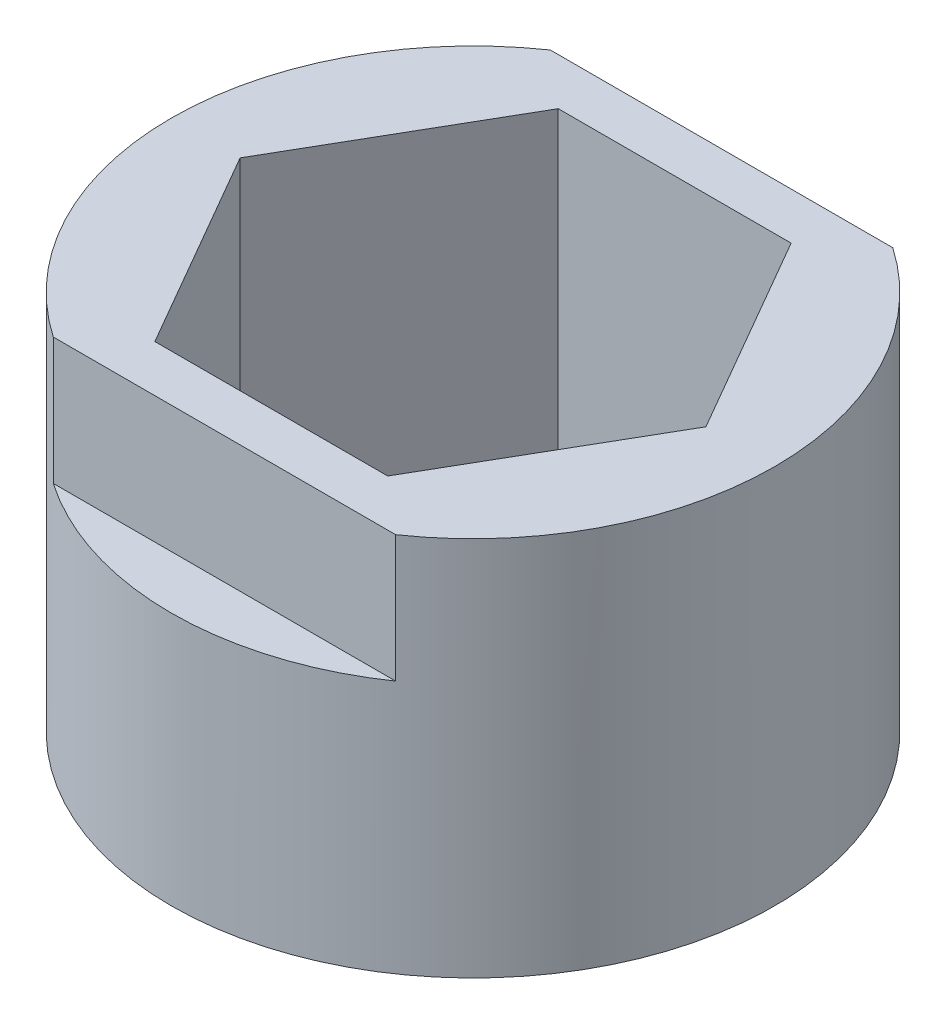
ISO-10303-21;
HEADER;
FILE_DESCRIPTION(('STEP AP214'),'2;1');
FILE_NAME('part.step','',(''),(''),'','','');
FILE_SCHEMA(('AUTOMOTIVE_DESIGN { 1 0 10303 214 1 1 1 1 }'));
ENDSEC;
DATA;
#1=APPLICATION_CONTEXT('core data for automotive mechanical design processes');
#2=APPLICATION_PROTOCOL_DEFINITION('international standard','automotive_design',2000,#1);
#3=PRODUCT_CONTEXT('',#1,'mechanical');
#4=PRODUCT('Part','Part','',(#3));
#5=PRODUCT_RELATED_PRODUCT_CATEGORY('part','',(#4));
#6=PRODUCT_DEFINITION_FORMATION('','',#4);
#7=PRODUCT_DEFINITION_CONTEXT('part definition',#1,'design');
#8=PRODUCT_DEFINITION('design','',#6,#7);
#9=PRODUCT_DEFINITION_SHAPE('','',#8);
#10=(LENGTH_UNIT() NAMED_UNIT(*) SI_UNIT(.MILLI.,.METRE.));
#11=(NAMED_UNIT(*) PLANE_ANGLE_UNIT() SI_UNIT($,.RADIAN.));
#12=(NAMED_UNIT(*) SI_UNIT($,.STERADIAN.) SOLID_ANGLE_UNIT());
#13=UNCERTAINTY_MEASURE_WITH_UNIT(LENGTH_MEASURE(1.E-05),#10,'distance_accuracy_value','');
#14=(GEOMETRIC_REPRESENTATION_CONTEXT(3) GLOBAL_UNCERTAINTY_ASSIGNED_CONTEXT((#13)) GLOBAL_UNIT_ASSIGNED_CONTEXT((#10,
#11,#12)) REPRESENTATION_CONTEXT('',''));
#15=CARTESIAN_POINT('',(0.,0.,0.));
#16=DIRECTION('',(0.,0.,1.));
#17=DIRECTION('',(1.,0.,0.));
#18=AXIS2_PLACEMENT_3D('',#15,#16,#17);
#19=CARTESIAN_POINT('',(0.,8.89,0.));
#20=DIRECTION('',(0.,1.,0.));
#21=DIRECTION('',(0.,0.,1.));
#22=AXIS2_PLACEMENT_3D('',#19,#20,#21);
#23=PLANE('',#22);
#24=DIRECTION('',(-1.,0.,0.));
#25=VECTOR('',#24,1.);
#26=CARTESIAN_POINT('',(0.,8.89,6.223));
#27=LINE('',#26,#25);
#28=CARTESIAN_POINT('',(4.28660276326137,8.89,6.223));
#29=VERTEX_POINT('',#28);
#30=CARTESIAN_POINT('',(-4.28660276326137,8.89,6.223));
#31=VERTEX_POINT('',#30);
#32=EDGE_CURVE('E151',#29,#31,#27,.T.);
#33=ORIENTED_EDGE('',*,*,#32,.F.);
#34=CARTESIAN_POINT('',(0.,8.89,0.));
#35=DIRECTION('',(0.,1.,0.));
#36=DIRECTION('',(0.,0.,1.));
#37=AXIS2_PLACEMENT_3D('',#34,#35,#36);
#38=CIRCLE('',#37,7.5565);
#39=CARTESIAN_POINT('',(4.28660276326137,8.89,-6.223));
#40=VERTEX_POINT('',#39);
#41=EDGE_CURVE('E153',#29,#40,#38,.T.);
#42=ORIENTED_EDGE('',*,*,#41,.T.);
#43=DIRECTION('',(1.,0.,0.));
#44=VECTOR('',#43,1.);
#45=CARTESIAN_POINT('',(0.,8.89,-6.223));
#46=LINE('',#45,#44);
#47=CARTESIAN_POINT('',(-4.28660276326137,8.89,-6.223));
#48=VERTEX_POINT('',#47);
#49=EDGE_CURVE('E62',#48,#40,#46,.T.);
#50=ORIENTED_EDGE('',*,*,#49,.F.);
#51=EDGE_CURVE('E135',#48,#31,#38,.T.);
#52=ORIENTED_EDGE('',*,*,#51,.T.);
#53=EDGE_LOOP('',(#33,#42,#50,#52));
#54=FACE_BOUND('',#53,.T.);
#55=DIRECTION('',(-0.5,0.,0.866025403784439));
#56=VECTOR('',#55,1.);
#57=CARTESIAN_POINT('',(-2.91561885940761,8.89,-5.05));
#58=LINE('',#57,#56);
#59=CARTESIAN_POINT('',(-2.91561885940761,8.89,-5.05));
#60=VERTEX_POINT('',#59);
#61=CARTESIAN_POINT('',(-5.83123771881522,8.89,0.));
#62=VERTEX_POINT('',#61);
#63=EDGE_CURVE('E190',#60,#62,#58,.T.);
#64=ORIENTED_EDGE('',*,*,#63,.F.);
#65=DIRECTION('',(-1.,0.,0.));
#66=VECTOR('',#65,1.);
#67=CARTESIAN_POINT('',(2.91561885940761,8.89,-5.05));
#68=LINE('',#67,#66);
#69=CARTESIAN_POINT('',(2.91561885940761,8.89,-5.05));
#70=VERTEX_POINT('',#69);
#71=EDGE_CURVE('E187',#70,#60,#68,.T.);
#72=ORIENTED_EDGE('',*,*,#71,.F.);
#73=DIRECTION('',(-0.5,0.,-0.866025403784439));
#74=VECTOR('',#73,1.);
#75=CARTESIAN_POINT('',(5.83123771881522,8.89,0.));
#76=LINE('',#75,#74);
#77=CARTESIAN_POINT('',(5.83123771881522,8.89,0.));
#78=VERTEX_POINT('',#77);
#79=EDGE_CURVE('E204',#78,#70,#76,.T.);
#80=ORIENTED_EDGE('',*,*,#79,.F.);
#81=DIRECTION('',(0.5,0.,-0.866025403784439));
#82=VECTOR('',#81,1.);
#83=CARTESIAN_POINT('',(2.91561885940761,8.89,5.05));
#84=LINE('',#83,#82);
#85=CARTESIAN_POINT('',(2.91561885940761,8.89,5.05));
#86=VERTEX_POINT('',#85);
#87=EDGE_CURVE('E200',#86,#78,#84,.T.);
#88=ORIENTED_EDGE('',*,*,#87,.F.);
#89=DIRECTION('',(1.,0.,0.));
#90=VECTOR('',#89,1.);
#91=CARTESIAN_POINT('',(-2.91561885940761,8.89,5.05));
#92=LINE('',#91,#90);
#93=CARTESIAN_POINT('',(-2.91561885940761,8.89,5.05));
#94=VERTEX_POINT('',#93);
#95=EDGE_CURVE('E197',#94,#86,#92,.T.);
#96=ORIENTED_EDGE('',*,*,#95,.F.);
#97=DIRECTION('',(0.5,0.,0.866025403784439));
#98=VECTOR('',#97,1.);
#99=CARTESIAN_POINT('',(-5.83123771881522,8.89,0.));
#100=LINE('',#99,#98);
#101=EDGE_CURVE('E194',#62,#94,#100,.T.);
#102=ORIENTED_EDGE('',*,*,#101,.F.);
#103=EDGE_LOOP('',(#64,#72,#80,#88,#96,#102));
#104=FACE_BOUND('',#103,.T.);
#105=ADVANCED_FACE('F39',(#54,#104),#23,.T.);
#106=CARTESIAN_POINT('',(0.,8.89,0.));
#107=DIRECTION('',(0.,-1.,0.));
#108=DIRECTION('',(0.,0.,-1.));
#109=AXIS2_PLACEMENT_3D('',#106,#107,#108);
#110=CYLINDRICAL_SURFACE('',#109,7.5565);
#111=ORIENTED_EDGE('',*,*,#41,.F.);
#112=DIRECTION('',(0.,-1.,0.));
#113=VECTOR('',#112,1.);
#114=CARTESIAN_POINT('',(4.28660276326137,8.89,6.223));
#115=LINE('',#114,#113);
#116=CARTESIAN_POINT('',(4.28660276326137,5.715,6.223));
#117=VERTEX_POINT('',#116);
#118=EDGE_CURVE('E11',#29,#117,#115,.T.);
#119=ORIENTED_EDGE('',*,*,#118,.T.);
#120=CARTESIAN_POINT('',(0.,5.715,0.));
#121=DIRECTION('',(0.,-1.,0.));
#122=DIRECTION('',(0.,0.,-1.));
#123=AXIS2_PLACEMENT_3D('',#120,#121,#122);
#124=CIRCLE('',#123,7.5565);
#125=CARTESIAN_POINT('',(-4.28660276326137,5.715,6.223));
#126=VERTEX_POINT('',#125);
#127=EDGE_CURVE('E137',#117,#126,#124,.T.);
#128=ORIENTED_EDGE('',*,*,#127,.T.);
#129=DIRECTION('',(0.,-1.,0.));
#130=VECTOR('',#129,1.);
#131=CARTESIAN_POINT('',(-4.28660276326137,8.89,6.223));
#132=LINE('',#131,#130);
#133=EDGE_CURVE('E48',#126,#31,#132,.F.);
#134=ORIENTED_EDGE('',*,*,#133,.T.);
#135=ORIENTED_EDGE('',*,*,#51,.F.);
#136=DIRECTION('',(0.,-1.,0.));
#137=VECTOR('',#136,1.);
#138=CARTESIAN_POINT('',(-4.28660276326137,8.89,-6.223));
#139=LINE('',#138,#137);
#140=CARTESIAN_POINT('',(-4.28660276326137,5.715,-6.223));
#141=VERTEX_POINT('',#140);
#142=EDGE_CURVE('E124',#48,#141,#139,.T.);
#143=ORIENTED_EDGE('',*,*,#142,.T.);
#144=CARTESIAN_POINT('',(0.,5.715,0.));
#145=DIRECTION('',(0.,-1.,0.));
#146=DIRECTION('',(0.,0.,-1.));
#147=AXIS2_PLACEMENT_3D('',#144,#145,#146);
#148=CIRCLE('',#147,7.5565);
#149=CARTESIAN_POINT('',(4.28660276326137,5.715,-6.223));
#150=VERTEX_POINT('',#149);
#151=EDGE_CURVE('E117',#141,#150,#148,.T.);
#152=ORIENTED_EDGE('',*,*,#151,.T.);
#153=DIRECTION('',(0.,-1.,0.));
#154=VECTOR('',#153,1.);
#155=CARTESIAN_POINT('',(4.28660276326137,8.89,-6.223));
#156=LINE('',#155,#154);
#157=EDGE_CURVE('E125',#150,#40,#156,.F.);
#158=ORIENTED_EDGE('',*,*,#157,.T.);
#159=EDGE_LOOP('',(#111,#119,#128,#134,#135,#143,#152,#158));
#160=FACE_BOUND('',#159,.T.);
#161=CARTESIAN_POINT('',(0.,-0.635,0.));
#162=DIRECTION('',(0.,-1.,0.));
#163=DIRECTION('',(0.,0.,-1.));
#164=AXIS2_PLACEMENT_3D('',#161,#162,#163);
#165=CIRCLE('',#164,7.5565);
#166=CARTESIAN_POINT('',(0.,-0.635,-7.5565));
#167=VERTEX_POINT('',#166);
#168=EDGE_CURVE('E179',#167,#167,#165,.T.);
#169=ORIENTED_EDGE('',*,*,#168,.F.);
#170=EDGE_LOOP('',(#169));
#171=FACE_BOUND('',#170,.T.);
#172=ADVANCED_FACE('F41',(#160,#171),#110,.T.);
#173=CARTESIAN_POINT('',(2.91561885940761,8.89,-5.05));
#174=DIRECTION('',(0.,0.,1.));
#175=DIRECTION('',(1.,0.,0.));
#176=AXIS2_PLACEMENT_3D('',#173,#174,#175);
#177=PLANE('',#176);
#178=DIRECTION('',(-1.,0.,0.));
#179=VECTOR('',#178,1.);
#180=CARTESIAN_POINT('',(2.91561885940761,0.,-5.05));
#181=LINE('',#180,#179);
#182=CARTESIAN_POINT('',(2.91561885940761,0.,-5.05));
#183=VERTEX_POINT('',#182);
#184=CARTESIAN_POINT('',(-2.91561885940761,0.,-5.05));
#185=VERTEX_POINT('',#184);
#186=EDGE_CURVE('E186',#183,#185,#181,.T.);
#187=ORIENTED_EDGE('',*,*,#186,.F.);
#188=DIRECTION('',(0.,-1.,0.));
#189=VECTOR('',#188,1.);
#190=CARTESIAN_POINT('',(2.91561885940761,8.89,-5.05));
#191=LINE('',#190,#189);
#192=EDGE_CURVE('E207',#70,#183,#191,.T.);
#193=ORIENTED_EDGE('',*,*,#192,.F.);
#194=ORIENTED_EDGE('',*,*,#71,.T.);
#195=DIRECTION('',(0.,-1.,0.));
#196=VECTOR('',#195,1.);
#197=CARTESIAN_POINT('',(-2.91561885940761,8.89,-5.05));
#198=LINE('',#197,#196);
#199=EDGE_CURVE('E154',#60,#185,#198,.T.);
#200=ORIENTED_EDGE('',*,*,#199,.T.);
#201=EDGE_LOOP('',(#187,#193,#194,#200));
#202=FACE_BOUND('',#201,.T.);
#203=ADVANCED_FACE('F259',(#202),#177,.T.);
#204=CARTESIAN_POINT('',(-2.91561885940761,8.89,-5.05));
#205=DIRECTION('',(0.866025403784439,0.,0.5));
#206=DIRECTION('',(0.5,0.,-0.866025403784439));
#207=AXIS2_PLACEMENT_3D('',#204,#205,#206);
#208=PLANE('',#207);
#209=DIRECTION('',(-0.5,0.,0.866025403784439));
#210=VECTOR('',#209,1.);
#211=CARTESIAN_POINT('',(-2.91561885940761,0.,-5.05));
#212=LINE('',#211,#210);
#213=CARTESIAN_POINT('',(-5.83123771881522,0.,0.));
#214=VERTEX_POINT('',#213);
#215=EDGE_CURVE('E211',#185,#214,#212,.T.);
#216=ORIENTED_EDGE('',*,*,#215,.F.);
#217=ORIENTED_EDGE('',*,*,#199,.F.);
#218=ORIENTED_EDGE('',*,*,#63,.T.);
#219=DIRECTION('',(0.,-1.,0.));
#220=VECTOR('',#219,1.);
#221=CARTESIAN_POINT('',(-5.83123771881522,8.89,0.));
#222=LINE('',#221,#220);
#223=EDGE_CURVE('E160',#62,#214,#222,.T.);
#224=ORIENTED_EDGE('',*,*,#223,.T.);
#225=EDGE_LOOP('',(#216,#217,#218,#224));
#226=FACE_BOUND('',#225,.T.);
#227=ADVANCED_FACE('F245',(#226),#208,.T.);
#228=CARTESIAN_POINT('',(-5.83123771881522,8.89,0.));
#229=DIRECTION('',(0.866025403784439,0.,-0.5));
#230=DIRECTION('',(-0.5,0.,-0.866025403784439));
#231=AXIS2_PLACEMENT_3D('',#228,#229,#230);
#232=PLANE('',#231);
#233=DIRECTION('',(0.5,0.,0.866025403784439));
#234=VECTOR('',#233,1.);
#235=CARTESIAN_POINT('',(-5.83123771881522,0.,0.));
#236=LINE('',#235,#234);
#237=CARTESIAN_POINT('',(-2.91561885940761,0.,5.05));
#238=VERTEX_POINT('',#237);
#239=EDGE_CURVE('E215',#214,#238,#236,.T.);
#240=ORIENTED_EDGE('',*,*,#239,.F.);
#241=ORIENTED_EDGE('',*,*,#223,.F.);
#242=ORIENTED_EDGE('',*,*,#101,.T.);
#243=DIRECTION('',(0.,-1.,0.));
#244=VECTOR('',#243,1.);
#245=CARTESIAN_POINT('',(-2.91561885940761,8.89,5.05));
#246=LINE('',#245,#244);
#247=EDGE_CURVE('E238',#94,#238,#246,.T.);
#248=ORIENTED_EDGE('',*,*,#247,.T.);
#249=EDGE_LOOP('',(#240,#241,#242,#248));
#250=FACE_BOUND('',#249,.T.);
#251=ADVANCED_FACE('F250',(#250),#232,.T.);
#252=CARTESIAN_POINT('',(-2.91561885940761,8.89,5.05));
#253=DIRECTION('',(0.,0.,-1.));
#254=DIRECTION('',(-1.,0.,0.));
#255=AXIS2_PLACEMENT_3D('',#252,#253,#254);
#256=PLANE('',#255);
#257=DIRECTION('',(1.,0.,0.));
#258=VECTOR('',#257,1.);
#259=CARTESIAN_POINT('',(-2.91561885940761,0.,5.05));
#260=LINE('',#259,#258);
#261=CARTESIAN_POINT('',(2.91561885940761,0.,5.05));
#262=VERTEX_POINT('',#261);
#263=EDGE_CURVE('E219',#238,#262,#260,.T.);
#264=ORIENTED_EDGE('',*,*,#263,.F.);
#265=ORIENTED_EDGE('',*,*,#247,.F.);
#266=ORIENTED_EDGE('',*,*,#95,.T.);
#267=DIRECTION('',(0.,-1.,0.));
#268=VECTOR('',#267,1.);
#269=CARTESIAN_POINT('',(2.91561885940761,8.89,5.05));
#270=LINE('',#269,#268);
#271=EDGE_CURVE('E235',#86,#262,#270,.T.);
#272=ORIENTED_EDGE('',*,*,#271,.T.);
#273=EDGE_LOOP('',(#264,#265,#266,#272));
#274=FACE_BOUND('',#273,.T.);
#275=ADVANCED_FACE('F265',(#274),#256,.T.);
#276=CARTESIAN_POINT('',(2.91561885940761,8.89,5.05));
#277=DIRECTION('',(-0.866025403784439,0.,-0.5));
#278=DIRECTION('',(-0.5,0.,0.866025403784439));
#279=AXIS2_PLACEMENT_3D('',#276,#277,#278);
#280=PLANE('',#279);
#281=DIRECTION('',(0.5,0.,-0.866025403784439));
#282=VECTOR('',#281,1.);
#283=CARTESIAN_POINT('',(2.91561885940761,0.,5.05));
#284=LINE('',#283,#282);
#285=CARTESIAN_POINT('',(5.83123771881522,0.,0.));
#286=VERTEX_POINT('',#285);
#287=EDGE_CURVE('E223',#262,#286,#284,.T.);
#288=ORIENTED_EDGE('',*,*,#287,.F.);
#289=ORIENTED_EDGE('',*,*,#271,.F.);
#290=ORIENTED_EDGE('',*,*,#87,.T.);
#291=DIRECTION('',(0.,-1.,0.));
#292=VECTOR('',#291,1.);
#293=CARTESIAN_POINT('',(5.83123771881522,8.89,0.));
#294=LINE('',#293,#292);
#295=EDGE_CURVE('E232',#78,#286,#294,.T.);
#296=ORIENTED_EDGE('',*,*,#295,.T.);
#297=EDGE_LOOP('',(#288,#289,#290,#296));
#298=FACE_BOUND('',#297,.T.);
#299=ADVANCED_FACE('F269',(#298),#280,.T.);
#300=CARTESIAN_POINT('',(5.83123771881522,8.89,0.));
#301=DIRECTION('',(-0.866025403784439,0.,0.5));
#302=DIRECTION('',(0.5,0.,0.866025403784439));
#303=AXIS2_PLACEMENT_3D('',#300,#301,#302);
#304=PLANE('',#303);
#305=DIRECTION('',(-0.5,0.,-0.866025403784439));
#306=VECTOR('',#305,1.);
#307=CARTESIAN_POINT('',(5.83123771881522,0.,0.));
#308=LINE('',#307,#306);
#309=EDGE_CURVE('E191',#286,#183,#308,.T.);
#310=ORIENTED_EDGE('',*,*,#309,.F.);
#311=ORIENTED_EDGE('',*,*,#295,.F.);
#312=ORIENTED_EDGE('',*,*,#79,.T.);
#313=ORIENTED_EDGE('',*,*,#192,.T.);
#314=EDGE_LOOP('',(#310,#311,#312,#313));
#315=FACE_BOUND('',#314,.T.);
#316=ADVANCED_FACE('F271',(#315),#304,.T.);
#317=CARTESIAN_POINT('',(0.,0.,0.));
#318=DIRECTION('',(0.,-1.,0.));
#319=DIRECTION('',(0.,0.,-1.));
#320=AXIS2_PLACEMENT_3D('',#317,#318,#319);
#321=PLANE('',#320);
#322=CARTESIAN_POINT('',(0.,0.,0.));
#323=DIRECTION('',(0.,-1.,0.));
#324=DIRECTION('',(0.,0.,-1.));
#325=AXIS2_PLACEMENT_3D('',#322,#323,#324);
#326=CIRCLE('',#325,3.3);
#327=CARTESIAN_POINT('',(0.,0.,-3.3));
#328=VERTEX_POINT('',#327);
#329=EDGE_CURVE('E174',#328,#328,#326,.T.);
#330=ORIENTED_EDGE('',*,*,#329,.T.);
#331=EDGE_LOOP('',(#330));
#332=FACE_BOUND('',#331,.T.);
#333=ORIENTED_EDGE('',*,*,#309,.T.);
#334=ORIENTED_EDGE('',*,*,#186,.T.);
#335=ORIENTED_EDGE('',*,*,#215,.T.);
#336=ORIENTED_EDGE('',*,*,#239,.T.);
#337=ORIENTED_EDGE('',*,*,#263,.T.);
#338=ORIENTED_EDGE('',*,*,#287,.T.);
#339=EDGE_LOOP('',(#333,#334,#335,#336,#337,#338));
#340=FACE_BOUND('',#339,.T.);
#341=ADVANCED_FACE('F254',(#332,#340),#321,.F.);
#342=CARTESIAN_POINT('',(0.,-0.635,0.));
#343=DIRECTION('',(0.,-1.,0.));
#344=DIRECTION('',(0.,0.,-1.));
#345=AXIS2_PLACEMENT_3D('',#342,#343,#344);
#346=PLANE('',#345);
#347=ORIENTED_EDGE('',*,*,#168,.T.);
#348=EDGE_LOOP('',(#347));
#349=FACE_BOUND('',#348,.T.);
#350=CARTESIAN_POINT('',(0.,-0.635,0.));
#351=DIRECTION('',(0.,-1.,0.));
#352=DIRECTION('',(0.,0.,-1.));
#353=AXIS2_PLACEMENT_3D('',#350,#351,#352);
#354=CIRCLE('',#353,3.3);
#355=CARTESIAN_POINT('',(0.,-0.635,-3.3));
#356=VERTEX_POINT('',#355);
#357=EDGE_CURVE('E175',#356,#356,#354,.T.);
#358=ORIENTED_EDGE('',*,*,#357,.F.);
#359=EDGE_LOOP('',(#358));
#360=FACE_BOUND('',#359,.T.);
#361=ADVANCED_FACE('F278',(#349,#360),#346,.T.);
#362=CARTESIAN_POINT('',(0.,-0.635,0.));
#363=DIRECTION('',(0.,1.,0.));
#364=DIRECTION('',(0.,0.,1.));
#365=AXIS2_PLACEMENT_3D('',#362,#363,#364);
#366=CYLINDRICAL_SURFACE('',#365,3.3);
#367=ORIENTED_EDGE('',*,*,#357,.T.);
#368=EDGE_LOOP('',(#367));
#369=FACE_BOUND('',#368,.T.);
#370=ORIENTED_EDGE('',*,*,#329,.F.);
#371=EDGE_LOOP('',(#370));
#372=FACE_BOUND('',#371,.T.);
#373=ADVANCED_FACE('F325',(#369,#372),#366,.F.);
#374=CARTESIAN_POINT('',(-7.5565,5.715,-8.47905548205234));
#375=DIRECTION('',(0.,-1.,0.));
#376=DIRECTION('',(0.,0.,-1.));
#377=AXIS2_PLACEMENT_3D('',#374,#375,#376);
#378=PLANE('',#377);
#379=DIRECTION('',(1.,0.,0.));
#380=VECTOR('',#379,1.);
#381=CARTESIAN_POINT('',(-7.5565,5.715,-6.223));
#382=LINE('',#381,#380);
#383=EDGE_CURVE('E120',#141,#150,#382,.T.);
#384=ORIENTED_EDGE('',*,*,#383,.T.);
#385=ORIENTED_EDGE('',*,*,#151,.F.);
#386=EDGE_LOOP('',(#384,#385));
#387=FACE_BOUND('',#386,.T.);
#388=ADVANCED_FACE('F119',(#387),#378,.F.);
#389=CARTESIAN_POINT('',(-7.5565,9.525,-6.223));
#390=DIRECTION('',(0.,0.,1.));
#391=DIRECTION('',(0.,-1.,0.));
#392=AXIS2_PLACEMENT_3D('',#389,#390,#391);
#393=PLANE('',#392);
#394=ORIENTED_EDGE('',*,*,#49,.T.);
#395=ORIENTED_EDGE('',*,*,#157,.F.);
#396=ORIENTED_EDGE('',*,*,#383,.F.);
#397=ORIENTED_EDGE('',*,*,#142,.F.);
#398=EDGE_LOOP('',(#394,#395,#396,#397));
#399=FACE_BOUND('',#398,.T.);
#400=ADVANCED_FACE('F127',(#399),#393,.F.);
#401=CARTESIAN_POINT('',(-7.5565,9.525,6.223));
#402=DIRECTION('',(0.,0.,-1.));
#403=DIRECTION('',(0.,1.,0.));
#404=AXIS2_PLACEMENT_3D('',#401,#402,#403);
#405=PLANE('',#404);
#406=ORIENTED_EDGE('',*,*,#32,.T.);
#407=ORIENTED_EDGE('',*,*,#133,.F.);
#408=DIRECTION('',(1.,0.,0.));
#409=VECTOR('',#408,1.);
#410=CARTESIAN_POINT('',(-7.5565,5.715,6.223));
#411=LINE('',#410,#409);
#412=EDGE_CURVE('E54',#126,#117,#411,.T.);
#413=ORIENTED_EDGE('',*,*,#412,.T.);
#414=ORIENTED_EDGE('',*,*,#118,.F.);
#415=EDGE_LOOP('',(#406,#407,#413,#414));
#416=FACE_BOUND('',#415,.T.);
#417=ADVANCED_FACE('F165',(#416),#405,.F.);
#418=CARTESIAN_POINT('',(-7.5565,5.715,8.20200981711855));
#419=DIRECTION('',(0.,-1.,0.));
#420=DIRECTION('',(0.,0.,-1.));
#421=AXIS2_PLACEMENT_3D('',#418,#419,#420);
#422=PLANE('',#421);
#423=ORIENTED_EDGE('',*,*,#412,.F.);
#424=ORIENTED_EDGE('',*,*,#127,.F.);
#425=EDGE_LOOP('',(#423,#424));
#426=FACE_BOUND('',#425,.T.);
#427=ADVANCED_FACE('F375',(#426),#422,.F.);
#428=CLOSED_SHELL('',(#105,#172,#203,#227,#251,#275,#299,#316,#341,#361,#373,#388,#400,#417,#427));
#429=MANIFOLD_SOLID_BREP('B2',#428);
#430=ADVANCED_BREP_SHAPE_REPRESENTATION('',(#18,#429),#14);
#431=SHAPE_DEFINITION_REPRESENTATION(#9,#430);
ENDSEC;
END-ISO-10303-21;
